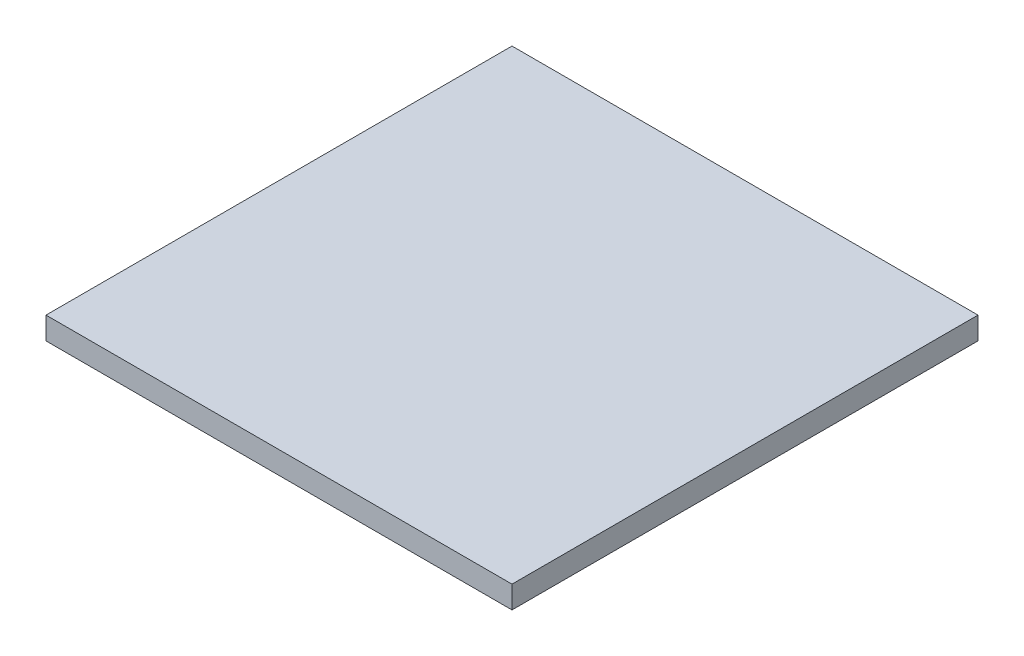
ISO-10303-21;
HEADER;
FILE_DESCRIPTION(('STEP AP214'),'2;1');
FILE_NAME('part.step','',(''),(''),'','','');
FILE_SCHEMA(('AUTOMOTIVE_DESIGN { 1 0 10303 214 1 1 1 1 }'));
ENDSEC;
DATA;
#1=APPLICATION_CONTEXT('core data for automotive mechanical design processes');
#2=APPLICATION_PROTOCOL_DEFINITION('international standard','automotive_design',2000,#1);
#3=PRODUCT_CONTEXT('',#1,'mechanical');
#4=PRODUCT('Part','Part','',(#3));
#5=PRODUCT_RELATED_PRODUCT_CATEGORY('part','',(#4));
#6=PRODUCT_DEFINITION_FORMATION('','',#4);
#7=PRODUCT_DEFINITION_CONTEXT('part definition',#1,'design');
#8=PRODUCT_DEFINITION('design','',#6,#7);
#9=PRODUCT_DEFINITION_SHAPE('','',#8);
#10=(LENGTH_UNIT() NAMED_UNIT(*) SI_UNIT(.MILLI.,.METRE.));
#11=(NAMED_UNIT(*) PLANE_ANGLE_UNIT() SI_UNIT($,.RADIAN.));
#12=(NAMED_UNIT(*) SI_UNIT($,.STERADIAN.) SOLID_ANGLE_UNIT());
#13=UNCERTAINTY_MEASURE_WITH_UNIT(LENGTH_MEASURE(1.E-05),#10,'distance_accuracy_value','');
#14=(GEOMETRIC_REPRESENTATION_CONTEXT(3) GLOBAL_UNCERTAINTY_ASSIGNED_CONTEXT((#13)) GLOBAL_UNIT_ASSIGNED_CONTEXT((#10,
#11,#12)) REPRESENTATION_CONTEXT('',''));
#15=CARTESIAN_POINT('',(0.,0.,0.));
#16=DIRECTION('',(0.,0.,1.));
#17=DIRECTION('',(1.,0.,0.));
#18=AXIS2_PLACEMENT_3D('',#15,#16,#17);
#19=CARTESIAN_POINT('',(125.,12.,125.));
#20=DIRECTION('',(-1.,0.,0.));
#21=DIRECTION('',(0.,0.,1.));
#22=AXIS2_PLACEMENT_3D('',#19,#20,#21);
#23=PLANE('',#22);
#24=DIRECTION('',(0.,0.,-1.));
#25=VECTOR('',#24,1.);
#26=CARTESIAN_POINT('',(125.,0.,125.));
#27=LINE('',#26,#25);
#28=CARTESIAN_POINT('',(125.,0.,125.));
#29=VERTEX_POINT('',#28);
#30=CARTESIAN_POINT('',(125.,0.,-125.));
#31=VERTEX_POINT('',#30);
#32=EDGE_CURVE('E95',#29,#31,#27,.T.);
#33=ORIENTED_EDGE('',*,*,#32,.T.);
#34=DIRECTION('',(0.,-1.,0.));
#35=VECTOR('',#34,1.);
#36=CARTESIAN_POINT('',(125.,12.,-125.));
#37=LINE('',#36,#35);
#38=CARTESIAN_POINT('',(125.,12.,-125.));
#39=VERTEX_POINT('',#38);
#40=EDGE_CURVE('E11',#39,#31,#37,.T.);
#41=ORIENTED_EDGE('',*,*,#40,.F.);
#42=DIRECTION('',(0.,0.,-1.));
#43=VECTOR('',#42,1.);
#44=CARTESIAN_POINT('',(125.,12.,125.));
#45=LINE('',#44,#43);
#46=CARTESIAN_POINT('',(125.,12.,125.));
#47=VERTEX_POINT('',#46);
#48=EDGE_CURVE('E83',#47,#39,#45,.T.);
#49=ORIENTED_EDGE('',*,*,#48,.F.);
#50=DIRECTION('',(0.,-1.,0.));
#51=VECTOR('',#50,1.);
#52=CARTESIAN_POINT('',(125.,12.,125.));
#53=LINE('',#52,#51);
#54=EDGE_CURVE('E91',#47,#29,#53,.T.);
#55=ORIENTED_EDGE('',*,*,#54,.T.);
#56=EDGE_LOOP('',(#33,#41,#49,#55));
#57=FACE_BOUND('',#56,.T.);
#58=ADVANCED_FACE('F32',(#57),#23,.F.);
#59=CARTESIAN_POINT('',(-125.,12.,-125.));
#60=DIRECTION('',(0.,0.,1.));
#61=DIRECTION('',(1.,0.,0.));
#62=AXIS2_PLACEMENT_3D('',#59,#60,#61);
#63=PLANE('',#62);
#64=DIRECTION('',(-1.,0.,0.));
#65=VECTOR('',#64,1.);
#66=CARTESIAN_POINT('',(-125.,0.,-125.));
#67=LINE('',#66,#65);
#68=CARTESIAN_POINT('',(-125.,0.,-125.));
#69=VERTEX_POINT('',#68);
#70=EDGE_CURVE('E87',#31,#69,#67,.T.);
#71=ORIENTED_EDGE('',*,*,#70,.T.);
#72=DIRECTION('',(0.,-1.,0.));
#73=VECTOR('',#72,1.);
#74=CARTESIAN_POINT('',(-125.,12.,-125.));
#75=LINE('',#74,#73);
#76=CARTESIAN_POINT('',(-125.,12.,-125.));
#77=VERTEX_POINT('',#76);
#78=EDGE_CURVE('E40',#77,#69,#75,.T.);
#79=ORIENTED_EDGE('',*,*,#78,.F.);
#80=DIRECTION('',(-1.,0.,0.));
#81=VECTOR('',#80,1.);
#82=CARTESIAN_POINT('',(-125.,12.,-125.));
#83=LINE('',#82,#81);
#84=EDGE_CURVE('E78',#39,#77,#83,.T.);
#85=ORIENTED_EDGE('',*,*,#84,.F.);
#86=ORIENTED_EDGE('',*,*,#40,.T.);
#87=EDGE_LOOP('',(#71,#79,#85,#86));
#88=FACE_BOUND('',#87,.T.);
#89=ADVANCED_FACE('F86',(#88),#63,.F.);
#90=CARTESIAN_POINT('',(-125.,12.,125.));
#91=DIRECTION('',(1.,0.,0.));
#92=DIRECTION('',(0.,0.,-1.));
#93=AXIS2_PLACEMENT_3D('',#90,#91,#92);
#94=PLANE('',#93);
#95=DIRECTION('',(0.,0.,1.));
#96=VECTOR('',#95,1.);
#97=CARTESIAN_POINT('',(-125.,0.,125.));
#98=LINE('',#97,#96);
#99=CARTESIAN_POINT('',(-125.,0.,125.));
#100=VERTEX_POINT('',#99);
#101=EDGE_CURVE('E65',#69,#100,#98,.T.);
#102=ORIENTED_EDGE('',*,*,#101,.T.);
#103=DIRECTION('',(0.,-1.,0.));
#104=VECTOR('',#103,1.);
#105=CARTESIAN_POINT('',(-125.,12.,125.));
#106=LINE('',#105,#104);
#107=CARTESIAN_POINT('',(-125.,12.,125.));
#108=VERTEX_POINT('',#107);
#109=EDGE_CURVE('E88',#108,#100,#106,.T.);
#110=ORIENTED_EDGE('',*,*,#109,.F.);
#111=DIRECTION('',(0.,0.,1.));
#112=VECTOR('',#111,1.);
#113=CARTESIAN_POINT('',(-125.,12.,125.));
#114=LINE('',#113,#112);
#115=EDGE_CURVE('E81',#77,#108,#114,.T.);
#116=ORIENTED_EDGE('',*,*,#115,.F.);
#117=ORIENTED_EDGE('',*,*,#78,.T.);
#118=EDGE_LOOP('',(#102,#110,#116,#117));
#119=FACE_BOUND('',#118,.T.);
#120=ADVANCED_FACE('F89',(#119),#94,.F.);
#121=CARTESIAN_POINT('',(-125.,12.,125.));
#122=DIRECTION('',(0.,0.,-1.));
#123=DIRECTION('',(-1.,0.,0.));
#124=AXIS2_PLACEMENT_3D('',#121,#122,#123);
#125=PLANE('',#124);
#126=DIRECTION('',(1.,0.,0.));
#127=VECTOR('',#126,1.);
#128=CARTESIAN_POINT('',(-125.,0.,125.));
#129=LINE('',#128,#127);
#130=EDGE_CURVE('E71',#100,#29,#129,.T.);
#131=ORIENTED_EDGE('',*,*,#130,.T.);
#132=ORIENTED_EDGE('',*,*,#54,.F.);
#133=DIRECTION('',(1.,0.,0.));
#134=VECTOR('',#133,1.);
#135=CARTESIAN_POINT('',(-125.,12.,125.));
#136=LINE('',#135,#134);
#137=EDGE_CURVE('E48',#108,#47,#136,.T.);
#138=ORIENTED_EDGE('',*,*,#137,.F.);
#139=ORIENTED_EDGE('',*,*,#109,.T.);
#140=EDGE_LOOP('',(#131,#132,#138,#139));
#141=FACE_BOUND('',#140,.T.);
#142=ADVANCED_FACE('F103',(#141),#125,.F.);
#143=CARTESIAN_POINT('',(0.,12.,0.));
#144=DIRECTION('',(0.,-1.,0.));
#145=DIRECTION('',(0.,0.,-1.));
#146=AXIS2_PLACEMENT_3D('',#143,#144,#145);
#147=PLANE('',#146);
#148=ORIENTED_EDGE('',*,*,#48,.T.);
#149=ORIENTED_EDGE('',*,*,#84,.T.);
#150=ORIENTED_EDGE('',*,*,#115,.T.);
#151=ORIENTED_EDGE('',*,*,#137,.T.);
#152=EDGE_LOOP('',(#148,#149,#150,#151));
#153=FACE_BOUND('',#152,.T.);
#154=ADVANCED_FACE('F79',(#153),#147,.F.);
#155=CARTESIAN_POINT('',(0.,0.,0.));
#156=DIRECTION('',(0.,-1.,0.));
#157=DIRECTION('',(0.,0.,-1.));
#158=AXIS2_PLACEMENT_3D('',#155,#156,#157);
#159=PLANE('',#158);
#160=CARTESIAN_POINT('',(-97.4999999999998,0.,-27.5000000000001));
#161=DIRECTION('',(0.,-1.,0.));
#162=DIRECTION('',(0.,0.,1.));
#163=AXIS2_PLACEMENT_3D('',#160,#161,#162);
#164=CIRCLE('',#163,3.50000000000001);
#165=CARTESIAN_POINT('',(-97.4999999999998,0.,-24.0000000000001));
#166=VERTEX_POINT('',#165);
#167=EDGE_CURVE('E146',#166,#166,#164,.T.);
#168=ORIENTED_EDGE('',*,*,#167,.F.);
#169=EDGE_LOOP('',(#168));
#170=FACE_BOUND('',#169,.T.);
#171=CARTESIAN_POINT('',(-73.5,0.,-45.5000000000001));
#172=DIRECTION('',(0.,-1.,0.));
#173=DIRECTION('',(0.,0.,1.));
#174=AXIS2_PLACEMENT_3D('',#171,#172,#173);
#175=CIRCLE('',#174,3.49999999999999);
#176=CARTESIAN_POINT('',(-73.5,0.,-42.0000000000001));
#177=VERTEX_POINT('',#176);
#178=EDGE_CURVE('E139',#177,#177,#175,.T.);
#179=ORIENTED_EDGE('',*,*,#178,.F.);
#180=EDGE_LOOP('',(#179));
#181=FACE_BOUND('',#180,.T.);
#182=CARTESIAN_POINT('',(-97.5,0.,-45.5000000000001));
#183=DIRECTION('',(0.,-1.,0.));
#184=DIRECTION('',(0.,0.,1.));
#185=AXIS2_PLACEMENT_3D('',#182,#183,#184);
#186=CIRCLE('',#185,3.50000000000002);
#187=CARTESIAN_POINT('',(-97.5,0.,-42.));
#188=VERTEX_POINT('',#187);
#189=EDGE_CURVE('E158',#188,#188,#186,.T.);
#190=ORIENTED_EDGE('',*,*,#189,.F.);
#191=EDGE_LOOP('',(#190));
#192=FACE_BOUND('',#191,.T.);
#193=CARTESIAN_POINT('',(97.5,0.,-45.5000000000001));
#194=DIRECTION('',(0.,-1.,0.));
#195=DIRECTION('',(0.,0.,-1.));
#196=AXIS2_PLACEMENT_3D('',#193,#194,#195);
#197=CIRCLE('',#196,3.50000000000002);
#198=CARTESIAN_POINT('',(97.5,0.,-49.0000000000001));
#199=VERTEX_POINT('',#198);
#200=EDGE_CURVE('E151',#199,#199,#197,.T.);
#201=ORIENTED_EDGE('',*,*,#200,.F.);
#202=EDGE_LOOP('',(#201));
#203=FACE_BOUND('',#202,.T.);
#204=CARTESIAN_POINT('',(-73.4999999999998,0.,-27.5000000000001));
#205=DIRECTION('',(0.,-1.,0.));
#206=DIRECTION('',(0.,0.,1.));
#207=AXIS2_PLACEMENT_3D('',#204,#205,#206);
#208=CIRCLE('',#207,3.49999999999999);
#209=CARTESIAN_POINT('',(-73.4999999999998,0.,-24.0000000000001));
#210=VERTEX_POINT('',#209);
#211=EDGE_CURVE('E122',#210,#210,#208,.T.);
#212=ORIENTED_EDGE('',*,*,#211,.F.);
#213=EDGE_LOOP('',(#212));
#214=FACE_BOUND('',#213,.T.);
#215=CARTESIAN_POINT('',(-73.5,0.,45.5));
#216=DIRECTION('',(0.,-1.,0.));
#217=DIRECTION('',(0.,0.,-1.));
#218=AXIS2_PLACEMENT_3D('',#215,#216,#217);
#219=CIRCLE('',#218,3.49999999999999);
#220=CARTESIAN_POINT('',(-73.5,0.,42.));
#221=VERTEX_POINT('',#220);
#222=EDGE_CURVE('E115',#221,#221,#219,.T.);
#223=ORIENTED_EDGE('',*,*,#222,.F.);
#224=EDGE_LOOP('',(#223));
#225=FACE_BOUND('',#224,.T.);
#226=CARTESIAN_POINT('',(-97.4999999999998,0.,27.5));
#227=DIRECTION('',(0.,-1.,0.));
#228=DIRECTION('',(0.,0.,-1.));
#229=AXIS2_PLACEMENT_3D('',#226,#227,#228);
#230=CIRCLE('',#229,3.50000000000001);
#231=CARTESIAN_POINT('',(-97.4999999999998,0.,24.));
#232=VERTEX_POINT('',#231);
#233=EDGE_CURVE('E134',#232,#232,#230,.T.);
#234=ORIENTED_EDGE('',*,*,#233,.F.);
#235=EDGE_LOOP('',(#234));
#236=FACE_BOUND('',#235,.T.);
#237=CARTESIAN_POINT('',(-73.4999999999998,0.,27.5));
#238=DIRECTION('',(0.,-1.,0.));
#239=DIRECTION('',(0.,0.,-1.));
#240=AXIS2_PLACEMENT_3D('',#237,#238,#239);
#241=CIRCLE('',#240,3.49999999999999);
#242=CARTESIAN_POINT('',(-73.4999999999998,0.,24.));
#243=VERTEX_POINT('',#242);
#244=EDGE_CURVE('E127',#243,#243,#241,.T.);
#245=ORIENTED_EDGE('',*,*,#244,.F.);
#246=EDGE_LOOP('',(#245));
#247=FACE_BOUND('',#246,.T.);
#248=CARTESIAN_POINT('',(97.4999999999998,0.,27.5));
#249=DIRECTION('',(0.,-1.,0.));
#250=DIRECTION('',(0.,0.,1.));
#251=AXIS2_PLACEMENT_3D('',#248,#249,#250);
#252=CIRCLE('',#251,3.50000000000001);
#253=CARTESIAN_POINT('',(97.4999999999998,0.,31.));
#254=VERTEX_POINT('',#253);
#255=EDGE_CURVE('E194',#254,#254,#252,.T.);
#256=ORIENTED_EDGE('',*,*,#255,.F.);
#257=EDGE_LOOP('',(#256));
#258=FACE_BOUND('',#257,.T.);
#259=CARTESIAN_POINT('',(73.5,0.,45.5));
#260=DIRECTION('',(0.,-1.,0.));
#261=DIRECTION('',(0.,0.,1.));
#262=AXIS2_PLACEMENT_3D('',#259,#260,#261);
#263=CIRCLE('',#262,3.49999999999999);
#264=CARTESIAN_POINT('',(73.5,0.,49.));
#265=VERTEX_POINT('',#264);
#266=EDGE_CURVE('E187',#265,#265,#263,.T.);
#267=ORIENTED_EDGE('',*,*,#266,.F.);
#268=EDGE_LOOP('',(#267));
#269=FACE_BOUND('',#268,.T.);
#270=CARTESIAN_POINT('',(97.5,0.,45.5));
#271=DIRECTION('',(0.,-1.,0.));
#272=DIRECTION('',(0.,0.,1.));
#273=AXIS2_PLACEMENT_3D('',#270,#271,#272);
#274=CIRCLE('',#273,3.50000000000001);
#275=CARTESIAN_POINT('',(97.5,0.,49.));
#276=VERTEX_POINT('',#275);
#277=EDGE_CURVE('E199',#276,#276,#274,.T.);
#278=ORIENTED_EDGE('',*,*,#277,.F.);
#279=EDGE_LOOP('',(#278));
#280=FACE_BOUND('',#279,.T.);
#281=CARTESIAN_POINT('',(73.5,0.,-45.5000000000001));
#282=DIRECTION('',(0.,-1.,0.));
#283=DIRECTION('',(0.,0.,-1.));
#284=AXIS2_PLACEMENT_3D('',#281,#282,#283);
#285=CIRCLE('',#284,3.49999999999999);
#286=CARTESIAN_POINT('',(73.5,0.,-49.0000000000001));
#287=VERTEX_POINT('',#286);
#288=EDGE_CURVE('E170',#287,#287,#285,.T.);
#289=ORIENTED_EDGE('',*,*,#288,.F.);
#290=EDGE_LOOP('',(#289));
#291=FACE_BOUND('',#290,.T.);
#292=CARTESIAN_POINT('',(97.4999999999998,0.,-27.5000000000001));
#293=DIRECTION('',(0.,-1.,0.));
#294=DIRECTION('',(0.,0.,-1.));
#295=AXIS2_PLACEMENT_3D('',#292,#293,#294);
#296=CIRCLE('',#295,3.50000000000001);
#297=CARTESIAN_POINT('',(97.4999999999998,0.,-31.0000000000001));
#298=VERTEX_POINT('',#297);
#299=EDGE_CURVE('E163',#298,#298,#296,.T.);
#300=ORIENTED_EDGE('',*,*,#299,.F.);
#301=EDGE_LOOP('',(#300));
#302=FACE_BOUND('',#301,.T.);
#303=CARTESIAN_POINT('',(73.4999999999998,0.,-27.5000000000001));
#304=DIRECTION('',(0.,-1.,0.));
#305=DIRECTION('',(0.,0.,-1.));
#306=AXIS2_PLACEMENT_3D('',#303,#304,#305);
#307=CIRCLE('',#306,3.49999999999999);
#308=CARTESIAN_POINT('',(73.4999999999998,0.,-31.0000000000001));
#309=VERTEX_POINT('',#308);
#310=EDGE_CURVE('E182',#309,#309,#307,.T.);
#311=ORIENTED_EDGE('',*,*,#310,.F.);
#312=EDGE_LOOP('',(#311));
#313=FACE_BOUND('',#312,.T.);
#314=CARTESIAN_POINT('',(73.4999999999998,0.,27.5));
#315=DIRECTION('',(0.,-1.,0.));
#316=DIRECTION('',(0.,0.,1.));
#317=AXIS2_PLACEMENT_3D('',#314,#315,#316);
#318=CIRCLE('',#317,3.49999999999999);
#319=CARTESIAN_POINT('',(73.4999999999998,0.,31.));
#320=VERTEX_POINT('',#319);
#321=EDGE_CURVE('E175',#320,#320,#318,.T.);
#322=ORIENTED_EDGE('',*,*,#321,.F.);
#323=EDGE_LOOP('',(#322));
#324=FACE_BOUND('',#323,.T.);
#325=CARTESIAN_POINT('',(-97.5,0.,45.5));
#326=DIRECTION('',(0.,-1.,0.));
#327=DIRECTION('',(0.,0.,-1.));
#328=AXIS2_PLACEMENT_3D('',#325,#326,#327);
#329=CIRCLE('',#328,3.50000000000001);
#330=CARTESIAN_POINT('',(-97.5,0.,42.));
#331=VERTEX_POINT('',#330);
#332=EDGE_CURVE('E109',#331,#331,#329,.T.);
#333=ORIENTED_EDGE('',*,*,#332,.F.);
#334=EDGE_LOOP('',(#333));
#335=FACE_BOUND('',#334,.T.);
#336=ORIENTED_EDGE('',*,*,#32,.F.);
#337=ORIENTED_EDGE('',*,*,#130,.F.);
#338=ORIENTED_EDGE('',*,*,#101,.F.);
#339=ORIENTED_EDGE('',*,*,#70,.F.);
#340=EDGE_LOOP('',(#336,#337,#338,#339));
#341=FACE_BOUND('',#340,.T.);
#342=ADVANCED_FACE('F106',(#170,#181,#192,#203,#214,#225,#236,#247,#258,#269,#280,#291,#302,
#313,#324,#335,#341),#159,.T.);
#343=CARTESIAN_POINT('',(-97.5,3.,45.5));
#344=DIRECTION('',(0.,-1.,0.));
#345=DIRECTION('',(0.,0.,-1.));
#346=AXIS2_PLACEMENT_3D('',#343,#344,#345);
#347=CYLINDRICAL_SURFACE('',#346,3.50000000000001);
#348=CARTESIAN_POINT('',(-97.5,3.,45.5));
#349=DIRECTION('',(0.,-1.,0.));
#350=DIRECTION('',(0.,0.,-1.));
#351=AXIS2_PLACEMENT_3D('',#348,#349,#350);
#352=CIRCLE('',#351,3.50000000000001);
#353=CARTESIAN_POINT('',(-97.5,3.,42.));
#354=VERTEX_POINT('',#353);
#355=EDGE_CURVE('E98',#354,#354,#352,.T.);
#356=ORIENTED_EDGE('',*,*,#355,.F.);
#357=EDGE_LOOP('',(#356));
#358=FACE_BOUND('',#357,.T.);
#359=ORIENTED_EDGE('',*,*,#332,.T.);
#360=EDGE_LOOP('',(#359));
#361=FACE_BOUND('',#360,.T.);
#362=ADVANCED_FACE('F216',(#358,#361),#347,.F.);
#363=CARTESIAN_POINT('',(-97.5,3.,45.5));
#364=DIRECTION('',(0.,-1.,0.));
#365=DIRECTION('',(0.,0.,-1.));
#366=AXIS2_PLACEMENT_3D('',#363,#364,#365);
#367=PLANE('',#366);
#368=ORIENTED_EDGE('',*,*,#355,.T.);
#369=EDGE_LOOP('',(#368));
#370=FACE_BOUND('',#369,.T.);
#371=ADVANCED_FACE('F230',(#370),#367,.T.);
#372=CARTESIAN_POINT('',(73.4999999999998,3.,27.5));
#373=DIRECTION('',(0.,-1.,0.));
#374=DIRECTION('',(0.,0.,-1.));
#375=AXIS2_PLACEMENT_3D('',#372,#373,#374);
#376=CYLINDRICAL_SURFACE('',#375,3.49999999999999);
#377=CARTESIAN_POINT('',(73.4999999999998,3.,27.5));
#378=DIRECTION('',(0.,-1.,0.));
#379=DIRECTION('',(0.,0.,1.));
#380=AXIS2_PLACEMENT_3D('',#377,#378,#379);
#381=CIRCLE('',#380,3.49999999999999);
#382=CARTESIAN_POINT('',(73.4999999999998,3.,31.));
#383=VERTEX_POINT('',#382);
#384=EDGE_CURVE('E178',#383,#383,#381,.T.);
#385=ORIENTED_EDGE('',*,*,#384,.F.);
#386=EDGE_LOOP('',(#385));
#387=FACE_BOUND('',#386,.T.);
#388=ORIENTED_EDGE('',*,*,#321,.T.);
#389=EDGE_LOOP('',(#388));
#390=FACE_BOUND('',#389,.T.);
#391=ADVANCED_FACE('F236',(#387,#390),#376,.F.);
#392=CARTESIAN_POINT('',(73.4999999999998,3.,27.5));
#393=DIRECTION('',(0.,1.,0.));
#394=DIRECTION('',(0.,0.,1.));
#395=AXIS2_PLACEMENT_3D('',#392,#393,#394);
#396=PLANE('',#395);
#397=ORIENTED_EDGE('',*,*,#384,.T.);
#398=EDGE_LOOP('',(#397));
#399=FACE_BOUND('',#398,.T.);
#400=ADVANCED_FACE('F279',(#399),#396,.F.);
#401=CARTESIAN_POINT('',(73.4999999999998,3.,-27.5000000000001));
#402=DIRECTION('',(0.,-1.,0.));
#403=DIRECTION('',(0.,0.,-1.));
#404=AXIS2_PLACEMENT_3D('',#401,#402,#403);
#405=CYLINDRICAL_SURFACE('',#404,3.49999999999999);
#406=CARTESIAN_POINT('',(73.4999999999998,3.,-27.5000000000001));
#407=DIRECTION('',(0.,-1.,0.));
#408=DIRECTION('',(0.,0.,-1.));
#409=AXIS2_PLACEMENT_3D('',#406,#407,#408);
#410=CIRCLE('',#409,3.49999999999999);
#411=CARTESIAN_POINT('',(73.4999999999998,3.,-31.0000000000001));
#412=VERTEX_POINT('',#411);
#413=EDGE_CURVE('E167',#412,#412,#410,.T.);
#414=ORIENTED_EDGE('',*,*,#413,.F.);
#415=EDGE_LOOP('',(#414));
#416=FACE_BOUND('',#415,.T.);
#417=ORIENTED_EDGE('',*,*,#310,.T.);
#418=EDGE_LOOP('',(#417));
#419=FACE_BOUND('',#418,.T.);
#420=ADVANCED_FACE('F289',(#416,#419),#405,.F.);
#421=CARTESIAN_POINT('',(73.4999999999998,3.,-27.5000000000001));
#422=DIRECTION('',(0.,-1.,0.));
#423=DIRECTION('',(0.,0.,-1.));
#424=AXIS2_PLACEMENT_3D('',#421,#422,#423);
#425=PLANE('',#424);
#426=ORIENTED_EDGE('',*,*,#413,.T.);
#427=EDGE_LOOP('',(#426));
#428=FACE_BOUND('',#427,.T.);
#429=ADVANCED_FACE('F299',(#428),#425,.T.);
#430=CARTESIAN_POINT('',(97.4999999999998,3.,-27.5000000000001));
#431=DIRECTION('',(0.,-1.,0.));
#432=DIRECTION('',(0.,0.,-1.));
#433=AXIS2_PLACEMENT_3D('',#430,#431,#432);
#434=CYLINDRICAL_SURFACE('',#433,3.50000000000001);
#435=CARTESIAN_POINT('',(97.4999999999998,3.,-27.5000000000001));
#436=DIRECTION('',(0.,-1.,0.));
#437=DIRECTION('',(0.,0.,-1.));
#438=AXIS2_PLACEMENT_3D('',#435,#436,#437);
#439=CIRCLE('',#438,3.50000000000001);
#440=CARTESIAN_POINT('',(97.4999999999998,3.,-31.0000000000001));
#441=VERTEX_POINT('',#440);
#442=EDGE_CURVE('E166',#441,#441,#439,.T.);
#443=ORIENTED_EDGE('',*,*,#442,.F.);
#444=EDGE_LOOP('',(#443));
#445=FACE_BOUND('',#444,.T.);
#446=ORIENTED_EDGE('',*,*,#299,.T.);
#447=EDGE_LOOP('',(#446));
#448=FACE_BOUND('',#447,.T.);
#449=ADVANCED_FACE('F309',(#445,#448),#434,.F.);
#450=CARTESIAN_POINT('',(97.4999999999998,3.,-27.5000000000001));
#451=DIRECTION('',(0.,-1.,0.));
#452=DIRECTION('',(0.,0.,-1.));
#453=AXIS2_PLACEMENT_3D('',#450,#451,#452);
#454=PLANE('',#453);
#455=ORIENTED_EDGE('',*,*,#442,.T.);
#456=EDGE_LOOP('',(#455));
#457=FACE_BOUND('',#456,.T.);
#458=ADVANCED_FACE('F319',(#457),#454,.T.);
#459=CARTESIAN_POINT('',(73.5,3.,-45.5000000000001));
#460=DIRECTION('',(0.,-1.,0.));
#461=DIRECTION('',(0.,0.,-1.));
#462=AXIS2_PLACEMENT_3D('',#459,#460,#461);
#463=CYLINDRICAL_SURFACE('',#462,3.49999999999999);
#464=CARTESIAN_POINT('',(73.5,3.,-45.5000000000001));
#465=DIRECTION('',(0.,-1.,0.));
#466=DIRECTION('',(0.,0.,-1.));
#467=AXIS2_PLACEMENT_3D('',#464,#465,#466);
#468=CIRCLE('',#467,3.49999999999999);
#469=CARTESIAN_POINT('',(73.5,3.,-49.0000000000001));
#470=VERTEX_POINT('',#469);
#471=EDGE_CURVE('E155',#470,#470,#468,.T.);
#472=ORIENTED_EDGE('',*,*,#471,.F.);
#473=EDGE_LOOP('',(#472));
#474=FACE_BOUND('',#473,.T.);
#475=ORIENTED_EDGE('',*,*,#288,.T.);
#476=EDGE_LOOP('',(#475));
#477=FACE_BOUND('',#476,.T.);
#478=ADVANCED_FACE('F329',(#474,#477),#463,.F.);
#479=CARTESIAN_POINT('',(73.5,3.,-45.5000000000001));
#480=DIRECTION('',(0.,-1.,0.));
#481=DIRECTION('',(0.,0.,-1.));
#482=AXIS2_PLACEMENT_3D('',#479,#480,#481);
#483=PLANE('',#482);
#484=ORIENTED_EDGE('',*,*,#471,.T.);
#485=EDGE_LOOP('',(#484));
#486=FACE_BOUND('',#485,.T.);
#487=ADVANCED_FACE('F210',(#486),#483,.T.);
#488=CARTESIAN_POINT('',(97.5,3.,45.5));
#489=DIRECTION('',(0.,-1.,0.));
#490=DIRECTION('',(0.,0.,-1.));
#491=AXIS2_PLACEMENT_3D('',#488,#489,#490);
#492=CYLINDRICAL_SURFACE('',#491,3.50000000000001);
#493=CARTESIAN_POINT('',(97.5,3.,45.5));
#494=DIRECTION('',(0.,-1.,0.));
#495=DIRECTION('',(0.,0.,1.));
#496=AXIS2_PLACEMENT_3D('',#493,#494,#495);
#497=CIRCLE('',#496,3.50000000000001);
#498=CARTESIAN_POINT('',(97.5,3.,49.));
#499=VERTEX_POINT('',#498);
#500=EDGE_CURVE('E191',#499,#499,#497,.T.);
#501=ORIENTED_EDGE('',*,*,#500,.F.);
#502=EDGE_LOOP('',(#501));
#503=FACE_BOUND('',#502,.T.);
#504=ORIENTED_EDGE('',*,*,#277,.T.);
#505=EDGE_LOOP('',(#504));
#506=FACE_BOUND('',#505,.T.);
#507=ADVANCED_FACE('F207',(#503,#506),#492,.F.);
#508=CARTESIAN_POINT('',(97.5,3.,45.5));
#509=DIRECTION('',(0.,1.,0.));
#510=DIRECTION('',(0.,0.,1.));
#511=AXIS2_PLACEMENT_3D('',#508,#509,#510);
#512=PLANE('',#511);
#513=ORIENTED_EDGE('',*,*,#500,.T.);
#514=EDGE_LOOP('',(#513));
#515=FACE_BOUND('',#514,.T.);
#516=ADVANCED_FACE('F205',(#515),#512,.F.);
#517=CARTESIAN_POINT('',(73.5,3.,45.5));
#518=DIRECTION('',(0.,-1.,0.));
#519=DIRECTION('',(0.,0.,-1.));
#520=AXIS2_PLACEMENT_3D('',#517,#518,#519);
#521=CYLINDRICAL_SURFACE('',#520,3.49999999999999);
#522=CARTESIAN_POINT('',(73.5,3.,45.5));
#523=DIRECTION('',(0.,-1.,0.));
#524=DIRECTION('',(0.,0.,1.));
#525=AXIS2_PLACEMENT_3D('',#522,#523,#524);
#526=CIRCLE('',#525,3.49999999999999);
#527=CARTESIAN_POINT('',(73.5,3.,49.));
#528=VERTEX_POINT('',#527);
#529=EDGE_CURVE('E190',#528,#528,#526,.T.);
#530=ORIENTED_EDGE('',*,*,#529,.F.);
#531=EDGE_LOOP('',(#530));
#532=FACE_BOUND('',#531,.T.);
#533=ORIENTED_EDGE('',*,*,#266,.T.);
#534=EDGE_LOOP('',(#533));
#535=FACE_BOUND('',#534,.T.);
#536=ADVANCED_FACE('F363',(#532,#535),#521,.F.);
#537=CARTESIAN_POINT('',(73.5,3.,45.5));
#538=DIRECTION('',(0.,1.,0.));
#539=DIRECTION('',(0.,0.,1.));
#540=AXIS2_PLACEMENT_3D('',#537,#538,#539);
#541=PLANE('',#540);
#542=ORIENTED_EDGE('',*,*,#529,.T.);
#543=EDGE_LOOP('',(#542));
#544=FACE_BOUND('',#543,.T.);
#545=ADVANCED_FACE('F372',(#544),#541,.F.);
#546=CARTESIAN_POINT('',(97.4999999999998,3.,27.5));
#547=DIRECTION('',(0.,-1.,0.));
#548=DIRECTION('',(0.,0.,-1.));
#549=AXIS2_PLACEMENT_3D('',#546,#547,#548);
#550=CYLINDRICAL_SURFACE('',#549,3.50000000000001);
#551=CARTESIAN_POINT('',(97.4999999999998,3.,27.5));
#552=DIRECTION('',(0.,-1.,0.));
#553=DIRECTION('',(0.,0.,1.));
#554=AXIS2_PLACEMENT_3D('',#551,#552,#553);
#555=CIRCLE('',#554,3.50000000000001);
#556=CARTESIAN_POINT('',(97.4999999999998,3.,31.));
#557=VERTEX_POINT('',#556);
#558=EDGE_CURVE('E179',#557,#557,#555,.T.);
#559=ORIENTED_EDGE('',*,*,#558,.F.);
#560=EDGE_LOOP('',(#559));
#561=FACE_BOUND('',#560,.T.);
#562=ORIENTED_EDGE('',*,*,#255,.T.);
#563=EDGE_LOOP('',(#562));
#564=FACE_BOUND('',#563,.T.);
#565=ADVANCED_FACE('F382',(#561,#564),#550,.F.);
#566=CARTESIAN_POINT('',(97.4999999999998,3.,27.5));
#567=DIRECTION('',(0.,1.,0.));
#568=DIRECTION('',(0.,0.,1.));
#569=AXIS2_PLACEMENT_3D('',#566,#567,#568);
#570=PLANE('',#569);
#571=ORIENTED_EDGE('',*,*,#558,.T.);
#572=EDGE_LOOP('',(#571));
#573=FACE_BOUND('',#572,.T.);
#574=ADVANCED_FACE('F392',(#573),#570,.F.);
#575=CARTESIAN_POINT('',(-73.4999999999998,3.,27.5));
#576=DIRECTION('',(0.,-1.,0.));
#577=DIRECTION('',(0.,0.,-1.));
#578=AXIS2_PLACEMENT_3D('',#575,#576,#577);
#579=CYLINDRICAL_SURFACE('',#578,3.49999999999999);
#580=CARTESIAN_POINT('',(-73.4999999999998,3.,27.5));
#581=DIRECTION('',(0.,-1.,0.));
#582=DIRECTION('',(0.,0.,-1.));
#583=AXIS2_PLACEMENT_3D('',#580,#581,#582);
#584=CIRCLE('',#583,3.49999999999999);
#585=CARTESIAN_POINT('',(-73.4999999999998,3.,24.));
#586=VERTEX_POINT('',#585);
#587=EDGE_CURVE('E130',#586,#586,#584,.T.);
#588=ORIENTED_EDGE('',*,*,#587,.F.);
#589=EDGE_LOOP('',(#588));
#590=FACE_BOUND('',#589,.T.);
#591=ORIENTED_EDGE('',*,*,#244,.T.);
#592=EDGE_LOOP('',(#591));
#593=FACE_BOUND('',#592,.T.);
#594=ADVANCED_FACE('F402',(#590,#593),#579,.F.);
#595=CARTESIAN_POINT('',(-73.4999999999998,3.,27.5));
#596=DIRECTION('',(0.,-1.,0.));
#597=DIRECTION('',(0.,0.,-1.));
#598=AXIS2_PLACEMENT_3D('',#595,#596,#597);
#599=PLANE('',#598);
#600=ORIENTED_EDGE('',*,*,#587,.T.);
#601=EDGE_LOOP('',(#600));
#602=FACE_BOUND('',#601,.T.);
#603=ADVANCED_FACE('F412',(#602),#599,.T.);
#604=CARTESIAN_POINT('',(-97.4999999999998,3.,27.5));
#605=DIRECTION('',(0.,-1.,0.));
#606=DIRECTION('',(0.,0.,-1.));
#607=AXIS2_PLACEMENT_3D('',#604,#605,#606);
#608=CYLINDRICAL_SURFACE('',#607,3.50000000000001);
#609=CARTESIAN_POINT('',(-97.4999999999998,3.,27.5));
#610=DIRECTION('',(0.,-1.,0.));
#611=DIRECTION('',(0.,0.,-1.));
#612=AXIS2_PLACEMENT_3D('',#609,#610,#611);
#613=CIRCLE('',#612,3.50000000000001);
#614=CARTESIAN_POINT('',(-97.4999999999998,3.,24.));
#615=VERTEX_POINT('',#614);
#616=EDGE_CURVE('E119',#615,#615,#613,.T.);
#617=ORIENTED_EDGE('',*,*,#616,.F.);
#618=EDGE_LOOP('',(#617));
#619=FACE_BOUND('',#618,.T.);
#620=ORIENTED_EDGE('',*,*,#233,.T.);
#621=EDGE_LOOP('',(#620));
#622=FACE_BOUND('',#621,.T.);
#623=ADVANCED_FACE('F422',(#619,#622),#608,.F.);
#624=CARTESIAN_POINT('',(-97.4999999999998,3.,27.5));
#625=DIRECTION('',(0.,-1.,0.));
#626=DIRECTION('',(0.,0.,-1.));
#627=AXIS2_PLACEMENT_3D('',#624,#625,#626);
#628=PLANE('',#627);
#629=ORIENTED_EDGE('',*,*,#616,.T.);
#630=EDGE_LOOP('',(#629));
#631=FACE_BOUND('',#630,.T.);
#632=ADVANCED_FACE('F432',(#631),#628,.T.);
#633=CARTESIAN_POINT('',(-73.5,3.,45.5));
#634=DIRECTION('',(0.,-1.,0.));
#635=DIRECTION('',(0.,0.,-1.));
#636=AXIS2_PLACEMENT_3D('',#633,#634,#635);
#637=CYLINDRICAL_SURFACE('',#636,3.49999999999999);
#638=CARTESIAN_POINT('',(-73.5,3.,45.5));
#639=DIRECTION('',(0.,-1.,0.));
#640=DIRECTION('',(0.,0.,-1.));
#641=AXIS2_PLACEMENT_3D('',#638,#639,#640);
#642=CIRCLE('',#641,3.49999999999999);
#643=CARTESIAN_POINT('',(-73.5,3.,42.));
#644=VERTEX_POINT('',#643);
#645=EDGE_CURVE('E118',#644,#644,#642,.T.);
#646=ORIENTED_EDGE('',*,*,#645,.F.);
#647=EDGE_LOOP('',(#646));
#648=FACE_BOUND('',#647,.T.);
#649=ORIENTED_EDGE('',*,*,#222,.T.);
#650=EDGE_LOOP('',(#649));
#651=FACE_BOUND('',#650,.T.);
#652=ADVANCED_FACE('F442',(#648,#651),#637,.F.);
#653=CARTESIAN_POINT('',(-73.5,3.,45.5));
#654=DIRECTION('',(0.,-1.,0.));
#655=DIRECTION('',(0.,0.,-1.));
#656=AXIS2_PLACEMENT_3D('',#653,#654,#655);
#657=PLANE('',#656);
#658=ORIENTED_EDGE('',*,*,#645,.T.);
#659=EDGE_LOOP('',(#658));
#660=FACE_BOUND('',#659,.T.);
#661=ADVANCED_FACE('F452',(#660),#657,.T.);
#662=CARTESIAN_POINT('',(-73.4999999999998,3.,-27.5000000000001));
#663=DIRECTION('',(0.,-1.,0.));
#664=DIRECTION('',(0.,0.,-1.));
#665=AXIS2_PLACEMENT_3D('',#662,#663,#664);
#666=CYLINDRICAL_SURFACE('',#665,3.49999999999999);
#667=CARTESIAN_POINT('',(-73.4999999999998,3.,-27.5000000000001));
#668=DIRECTION('',(0.,-1.,0.));
#669=DIRECTION('',(0.,0.,1.));
#670=AXIS2_PLACEMENT_3D('',#667,#668,#669);
#671=CIRCLE('',#670,3.49999999999999);
#672=CARTESIAN_POINT('',(-73.4999999999998,3.,-24.0000000000001));
#673=VERTEX_POINT('',#672);
#674=EDGE_CURVE('E112',#673,#673,#671,.T.);
#675=ORIENTED_EDGE('',*,*,#674,.F.);
#676=EDGE_LOOP('',(#675));
#677=FACE_BOUND('',#676,.T.);
#678=ORIENTED_EDGE('',*,*,#211,.T.);
#679=EDGE_LOOP('',(#678));
#680=FACE_BOUND('',#679,.T.);
#681=ADVANCED_FACE('F462',(#677,#680),#666,.F.);
#682=CARTESIAN_POINT('',(-73.4999999999998,3.,-27.5000000000001));
#683=DIRECTION('',(0.,1.,0.));
#684=DIRECTION('',(0.,0.,1.));
#685=AXIS2_PLACEMENT_3D('',#682,#683,#684);
#686=PLANE('',#685);
#687=ORIENTED_EDGE('',*,*,#674,.T.);
#688=EDGE_LOOP('',(#687));
#689=FACE_BOUND('',#688,.T.);
#690=ADVANCED_FACE('F472',(#689),#686,.F.);
#691=CARTESIAN_POINT('',(97.5,3.,-45.5000000000001));
#692=DIRECTION('',(0.,-1.,0.));
#693=DIRECTION('',(0.,0.,-1.));
#694=AXIS2_PLACEMENT_3D('',#691,#692,#693);
#695=CYLINDRICAL_SURFACE('',#694,3.50000000000002);
#696=CARTESIAN_POINT('',(97.5,3.,-45.5000000000001));
#697=DIRECTION('',(0.,-1.,0.));
#698=DIRECTION('',(0.,0.,-1.));
#699=AXIS2_PLACEMENT_3D('',#696,#697,#698);
#700=CIRCLE('',#699,3.50000000000002);
#701=CARTESIAN_POINT('',(97.5,3.,-49.0000000000001));
#702=VERTEX_POINT('',#701);
#703=EDGE_CURVE('E154',#702,#702,#700,.T.);
#704=ORIENTED_EDGE('',*,*,#703,.F.);
#705=EDGE_LOOP('',(#704));
#706=FACE_BOUND('',#705,.T.);
#707=ORIENTED_EDGE('',*,*,#200,.T.);
#708=EDGE_LOOP('',(#707));
#709=FACE_BOUND('',#708,.T.);
#710=ADVANCED_FACE('F482',(#706,#709),#695,.F.);
#711=CARTESIAN_POINT('',(97.5,3.,-45.5000000000001));
#712=DIRECTION('',(0.,-1.,0.));
#713=DIRECTION('',(0.,0.,-1.));
#714=AXIS2_PLACEMENT_3D('',#711,#712,#713);
#715=PLANE('',#714);
#716=ORIENTED_EDGE('',*,*,#703,.T.);
#717=EDGE_LOOP('',(#716));
#718=FACE_BOUND('',#717,.T.);
#719=ADVANCED_FACE('F492',(#718),#715,.T.);
#720=CARTESIAN_POINT('',(-97.5,3.,-45.5000000000001));
#721=DIRECTION('',(0.,-1.,0.));
#722=DIRECTION('',(0.,0.,-1.));
#723=AXIS2_PLACEMENT_3D('',#720,#721,#722);
#724=CYLINDRICAL_SURFACE('',#723,3.50000000000002);
#725=CARTESIAN_POINT('',(-97.5,3.,-45.5000000000001));
#726=DIRECTION('',(0.,-1.,0.));
#727=DIRECTION('',(0.,0.,1.));
#728=AXIS2_PLACEMENT_3D('',#725,#726,#727);
#729=CIRCLE('',#728,3.50000000000002);
#730=CARTESIAN_POINT('',(-97.5,3.,-42.));
#731=VERTEX_POINT('',#730);
#732=EDGE_CURVE('E143',#731,#731,#729,.T.);
#733=ORIENTED_EDGE('',*,*,#732,.F.);
#734=EDGE_LOOP('',(#733));
#735=FACE_BOUND('',#734,.T.);
#736=ORIENTED_EDGE('',*,*,#189,.T.);
#737=EDGE_LOOP('',(#736));
#738=FACE_BOUND('',#737,.T.);
#739=ADVANCED_FACE('F502',(#735,#738),#724,.F.);
#740=CARTESIAN_POINT('',(-97.5,3.,-45.5000000000001));
#741=DIRECTION('',(0.,1.,0.));
#742=DIRECTION('',(0.,0.,1.));
#743=AXIS2_PLACEMENT_3D('',#740,#741,#742);
#744=PLANE('',#743);
#745=ORIENTED_EDGE('',*,*,#732,.T.);
#746=EDGE_LOOP('',(#745));
#747=FACE_BOUND('',#746,.T.);
#748=ADVANCED_FACE('F512',(#747),#744,.F.);
#749=CARTESIAN_POINT('',(-73.5,3.,-45.5000000000001));
#750=DIRECTION('',(0.,-1.,0.));
#751=DIRECTION('',(0.,0.,-1.));
#752=AXIS2_PLACEMENT_3D('',#749,#750,#751);
#753=CYLINDRICAL_SURFACE('',#752,3.49999999999999);
#754=CARTESIAN_POINT('',(-73.5,3.,-45.5000000000001));
#755=DIRECTION('',(0.,-1.,0.));
#756=DIRECTION('',(0.,0.,1.));
#757=AXIS2_PLACEMENT_3D('',#754,#755,#756);
#758=CIRCLE('',#757,3.49999999999999);
#759=CARTESIAN_POINT('',(-73.5,3.,-42.0000000000001));
#760=VERTEX_POINT('',#759);
#761=EDGE_CURVE('E142',#760,#760,#758,.T.);
#762=ORIENTED_EDGE('',*,*,#761,.F.);
#763=EDGE_LOOP('',(#762));
#764=FACE_BOUND('',#763,.T.);
#765=ORIENTED_EDGE('',*,*,#178,.T.);
#766=EDGE_LOOP('',(#765));
#767=FACE_BOUND('',#766,.T.);
#768=ADVANCED_FACE('F522',(#764,#767),#753,.F.);
#769=CARTESIAN_POINT('',(-73.5,3.,-45.5000000000001));
#770=DIRECTION('',(0.,1.,0.));
#771=DIRECTION('',(0.,0.,1.));
#772=AXIS2_PLACEMENT_3D('',#769,#770,#771);
#773=PLANE('',#772);
#774=ORIENTED_EDGE('',*,*,#761,.T.);
#775=EDGE_LOOP('',(#774));
#776=FACE_BOUND('',#775,.T.);
#777=ADVANCED_FACE('F532',(#776),#773,.F.);
#778=CARTESIAN_POINT('',(-97.4999999999998,3.,-27.5000000000001));
#779=DIRECTION('',(0.,-1.,0.));
#780=DIRECTION('',(0.,0.,-1.));
#781=AXIS2_PLACEMENT_3D('',#778,#779,#780);
#782=CYLINDRICAL_SURFACE('',#781,3.50000000000001);
#783=CARTESIAN_POINT('',(-97.4999999999998,3.,-27.5000000000001));
#784=DIRECTION('',(0.,-1.,0.));
#785=DIRECTION('',(0.,0.,1.));
#786=AXIS2_PLACEMENT_3D('',#783,#784,#785);
#787=CIRCLE('',#786,3.50000000000001);
#788=CARTESIAN_POINT('',(-97.4999999999998,3.,-24.0000000000001));
#789=VERTEX_POINT('',#788);
#790=EDGE_CURVE('E131',#789,#789,#787,.T.);
#791=ORIENTED_EDGE('',*,*,#790,.F.);
#792=EDGE_LOOP('',(#791));
#793=FACE_BOUND('',#792,.T.);
#794=ORIENTED_EDGE('',*,*,#167,.T.);
#795=EDGE_LOOP('',(#794));
#796=FACE_BOUND('',#795,.T.);
#797=ADVANCED_FACE('F542',(#793,#796),#782,.F.);
#798=CARTESIAN_POINT('',(-97.4999999999998,3.,-27.5000000000001));
#799=DIRECTION('',(0.,1.,0.));
#800=DIRECTION('',(0.,0.,1.));
#801=AXIS2_PLACEMENT_3D('',#798,#799,#800);
#802=PLANE('',#801);
#803=ORIENTED_EDGE('',*,*,#790,.T.);
#804=EDGE_LOOP('',(#803));
#805=FACE_BOUND('',#804,.T.);
#806=ADVANCED_FACE('F552',(#805),#802,.F.);
#807=CLOSED_SHELL('',(#58,#89,#120,#142,#154,#342,#362,#371,#391,#400,#420,#429,#449,#458,#478,
#487,#507,#516,#536,#545,#565,#574,#594,#603,#623,#632,#652,#661,#681,#690,#710,#719,#739,#748,
#768,#777,#797,#806));
#808=MANIFOLD_SOLID_BREP('B2',#807);
#809=ADVANCED_BREP_SHAPE_REPRESENTATION('',(#18,#808),#14);
#810=SHAPE_DEFINITION_REPRESENTATION(#9,#809);
ENDSEC;
END-ISO-10303-21;
